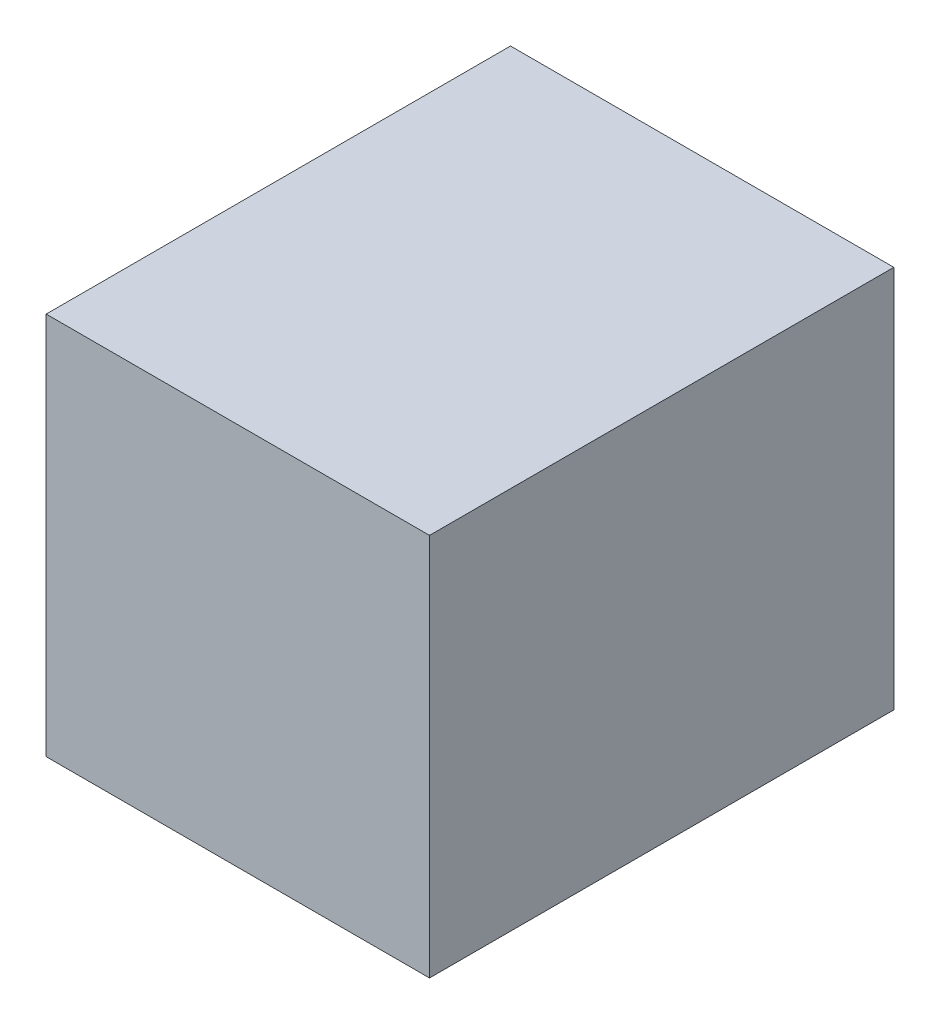
ISO-10303-21;
HEADER;
FILE_DESCRIPTION(('STEP AP214'),'2;1');
FILE_NAME('part.step','',(''),(''),'','','');
FILE_SCHEMA(('AUTOMOTIVE_DESIGN { 1 0 10303 214 1 1 1 1 }'));
ENDSEC;
DATA;
#1=APPLICATION_CONTEXT('core data for automotive mechanical design processes');
#2=APPLICATION_PROTOCOL_DEFINITION('international standard','automotive_design',2000,#1);
#3=PRODUCT_CONTEXT('',#1,'mechanical');
#4=PRODUCT('Part','Part','',(#3));
#5=PRODUCT_RELATED_PRODUCT_CATEGORY('part','',(#4));
#6=PRODUCT_DEFINITION_FORMATION('','',#4);
#7=PRODUCT_DEFINITION_CONTEXT('part definition',#1,'design');
#8=PRODUCT_DEFINITION('design','',#6,#7);
#9=PRODUCT_DEFINITION_SHAPE('','',#8);
#10=(LENGTH_UNIT() NAMED_UNIT(*) SI_UNIT(.MILLI.,.METRE.));
#11=(NAMED_UNIT(*) PLANE_ANGLE_UNIT() SI_UNIT($,.RADIAN.));
#12=(NAMED_UNIT(*) SI_UNIT($,.STERADIAN.) SOLID_ANGLE_UNIT());
#13=UNCERTAINTY_MEASURE_WITH_UNIT(LENGTH_MEASURE(1.E-05),#10,'distance_accuracy_value','');
#14=(GEOMETRIC_REPRESENTATION_CONTEXT(3) GLOBAL_UNCERTAINTY_ASSIGNED_CONTEXT((#13)) GLOBAL_UNIT_ASSIGNED_CONTEXT((#10,
#11,#12)) REPRESENTATION_CONTEXT('',''));
#15=CARTESIAN_POINT('',(0.,0.,0.));
#16=DIRECTION('',(0.,0.,1.));
#17=DIRECTION('',(1.,0.,0.));
#18=AXIS2_PLACEMENT_3D('',#15,#16,#17);
#19=CARTESIAN_POINT('',(0.,0.,123.063));
#20=DIRECTION('',(1.,0.,0.));
#21=DIRECTION('',(0.,0.,-1.));
#22=AXIS2_PLACEMENT_3D('',#19,#20,#21);
#23=PLANE('',#22);
#24=DIRECTION('',(0.,-1.,0.));
#25=VECTOR('',#24,1.);
#26=CARTESIAN_POINT('',(0.,0.,0.));
#27=LINE('',#26,#25);
#28=CARTESIAN_POINT('',(0.,101.6,0.));
#29=VERTEX_POINT('',#28);
#30=CARTESIAN_POINT('',(0.,0.,0.));
#31=VERTEX_POINT('',#30);
#32=EDGE_CURVE('E96',#29,#31,#27,.T.);
#33=ORIENTED_EDGE('',*,*,#32,.T.);
#34=DIRECTION('',(0.,0.,-1.));
#35=VECTOR('',#34,1.);
#36=CARTESIAN_POINT('',(0.,0.,123.063));
#37=LINE('',#36,#35);
#38=CARTESIAN_POINT('',(0.,0.,123.063));
#39=VERTEX_POINT('',#38);
#40=EDGE_CURVE('E11',#39,#31,#37,.T.);
#41=ORIENTED_EDGE('',*,*,#40,.F.);
#42=DIRECTION('',(0.,-1.,0.));
#43=VECTOR('',#42,1.);
#44=CARTESIAN_POINT('',(0.,0.,123.063));
#45=LINE('',#44,#43);
#46=CARTESIAN_POINT('',(0.,101.6,123.063));
#47=VERTEX_POINT('',#46);
#48=EDGE_CURVE('E84',#47,#39,#45,.T.);
#49=ORIENTED_EDGE('',*,*,#48,.F.);
#50=DIRECTION('',(0.,0.,-1.));
#51=VECTOR('',#50,1.);
#52=CARTESIAN_POINT('',(0.,101.6,123.063));
#53=LINE('',#52,#51);
#54=EDGE_CURVE('E92',#47,#29,#53,.T.);
#55=ORIENTED_EDGE('',*,*,#54,.T.);
#56=EDGE_LOOP('',(#33,#41,#49,#55));
#57=FACE_BOUND('',#56,.T.);
#58=ADVANCED_FACE('F33',(#57),#23,.F.);
#59=CARTESIAN_POINT('',(0.,0.,123.063));
#60=DIRECTION('',(0.,1.,0.));
#61=DIRECTION('',(0.,0.,1.));
#62=AXIS2_PLACEMENT_3D('',#59,#60,#61);
#63=PLANE('',#62);
#64=DIRECTION('',(1.,0.,0.));
#65=VECTOR('',#64,1.);
#66=CARTESIAN_POINT('',(0.,0.,0.));
#67=LINE('',#66,#65);
#68=CARTESIAN_POINT('',(101.6,0.,0.));
#69=VERTEX_POINT('',#68);
#70=EDGE_CURVE('E88',#31,#69,#67,.T.);
#71=ORIENTED_EDGE('',*,*,#70,.T.);
#72=DIRECTION('',(0.,0.,-1.));
#73=VECTOR('',#72,1.);
#74=CARTESIAN_POINT('',(101.6,0.,123.063));
#75=LINE('',#74,#73);
#76=CARTESIAN_POINT('',(101.6,0.,123.063));
#77=VERTEX_POINT('',#76);
#78=EDGE_CURVE('E41',#77,#69,#75,.T.);
#79=ORIENTED_EDGE('',*,*,#78,.F.);
#80=DIRECTION('',(1.,0.,0.));
#81=VECTOR('',#80,1.);
#82=CARTESIAN_POINT('',(0.,0.,123.063));
#83=LINE('',#82,#81);
#84=EDGE_CURVE('E79',#39,#77,#83,.T.);
#85=ORIENTED_EDGE('',*,*,#84,.F.);
#86=ORIENTED_EDGE('',*,*,#40,.T.);
#87=EDGE_LOOP('',(#71,#79,#85,#86));
#88=FACE_BOUND('',#87,.T.);
#89=ADVANCED_FACE('F87',(#88),#63,.F.);
#90=CARTESIAN_POINT('',(101.6,0.,123.063));
#91=DIRECTION('',(-1.,0.,0.));
#92=DIRECTION('',(0.,0.,1.));
#93=AXIS2_PLACEMENT_3D('',#90,#91,#92);
#94=PLANE('',#93);
#95=DIRECTION('',(0.,1.,0.));
#96=VECTOR('',#95,1.);
#97=CARTESIAN_POINT('',(101.6,0.,0.));
#98=LINE('',#97,#96);
#99=CARTESIAN_POINT('',(101.6,101.6,0.));
#100=VERTEX_POINT('',#99);
#101=EDGE_CURVE('E66',#69,#100,#98,.T.);
#102=ORIENTED_EDGE('',*,*,#101,.T.);
#103=DIRECTION('',(0.,0.,-1.));
#104=VECTOR('',#103,1.);
#105=CARTESIAN_POINT('',(101.6,101.6,123.063));
#106=LINE('',#105,#104);
#107=CARTESIAN_POINT('',(101.6,101.6,123.063));
#108=VERTEX_POINT('',#107);
#109=EDGE_CURVE('E89',#108,#100,#106,.T.);
#110=ORIENTED_EDGE('',*,*,#109,.F.);
#111=DIRECTION('',(0.,1.,0.));
#112=VECTOR('',#111,1.);
#113=CARTESIAN_POINT('',(101.6,0.,123.063));
#114=LINE('',#113,#112);
#115=EDGE_CURVE('E82',#77,#108,#114,.T.);
#116=ORIENTED_EDGE('',*,*,#115,.F.);
#117=ORIENTED_EDGE('',*,*,#78,.T.);
#118=EDGE_LOOP('',(#102,#110,#116,#117));
#119=FACE_BOUND('',#118,.T.);
#120=ADVANCED_FACE('F90',(#119),#94,.F.);
#121=CARTESIAN_POINT('',(0.,101.6,123.063));
#122=DIRECTION('',(0.,-1.,0.));
#123=DIRECTION('',(0.,0.,-1.));
#124=AXIS2_PLACEMENT_3D('',#121,#122,#123);
#125=PLANE('',#124);
#126=DIRECTION('',(-1.,0.,0.));
#127=VECTOR('',#126,1.);
#128=CARTESIAN_POINT('',(0.,101.6,0.));
#129=LINE('',#128,#127);
#130=EDGE_CURVE('E72',#100,#29,#129,.T.);
#131=ORIENTED_EDGE('',*,*,#130,.T.);
#132=ORIENTED_EDGE('',*,*,#54,.F.);
#133=DIRECTION('',(-1.,0.,0.));
#134=VECTOR('',#133,1.);
#135=CARTESIAN_POINT('',(0.,101.6,123.063));
#136=LINE('',#135,#134);
#137=EDGE_CURVE('E49',#108,#47,#136,.T.);
#138=ORIENTED_EDGE('',*,*,#137,.F.);
#139=ORIENTED_EDGE('',*,*,#109,.T.);
#140=EDGE_LOOP('',(#131,#132,#138,#139));
#141=FACE_BOUND('',#140,.T.);
#142=ADVANCED_FACE('F103',(#141),#125,.F.);
#143=CARTESIAN_POINT('',(0.,0.,123.063));
#144=DIRECTION('',(0.,0.,-1.));
#145=DIRECTION('',(-1.,0.,0.));
#146=AXIS2_PLACEMENT_3D('',#143,#144,#145);
#147=PLANE('',#146);
#148=ORIENTED_EDGE('',*,*,#48,.T.);
#149=ORIENTED_EDGE('',*,*,#84,.T.);
#150=ORIENTED_EDGE('',*,*,#115,.T.);
#151=ORIENTED_EDGE('',*,*,#137,.T.);
#152=EDGE_LOOP('',(#148,#149,#150,#151));
#153=FACE_BOUND('',#152,.T.);
#154=ADVANCED_FACE('F80',(#153),#147,.F.);
#155=CARTESIAN_POINT('',(0.,0.,0.));
#156=DIRECTION('',(0.,0.,-1.));
#157=DIRECTION('',(-1.,0.,0.));
#158=AXIS2_PLACEMENT_3D('',#155,#156,#157);
#159=PLANE('',#158);
#160=ORIENTED_EDGE('',*,*,#32,.F.);
#161=ORIENTED_EDGE('',*,*,#130,.F.);
#162=ORIENTED_EDGE('',*,*,#101,.F.);
#163=ORIENTED_EDGE('',*,*,#70,.F.);
#164=EDGE_LOOP('',(#160,#161,#162,#163));
#165=FACE_BOUND('',#164,.T.);
#166=ADVANCED_FACE('F106',(#165),#159,.T.);
#167=CLOSED_SHELL('',(#58,#89,#120,#142,#154,#166));
#168=MANIFOLD_SOLID_BREP('B2',#167);
#169=ADVANCED_BREP_SHAPE_REPRESENTATION('',(#18,#168),#14);
#170=SHAPE_DEFINITION_REPRESENTATION(#9,#169);
ENDSEC;
END-ISO-10303-21;
